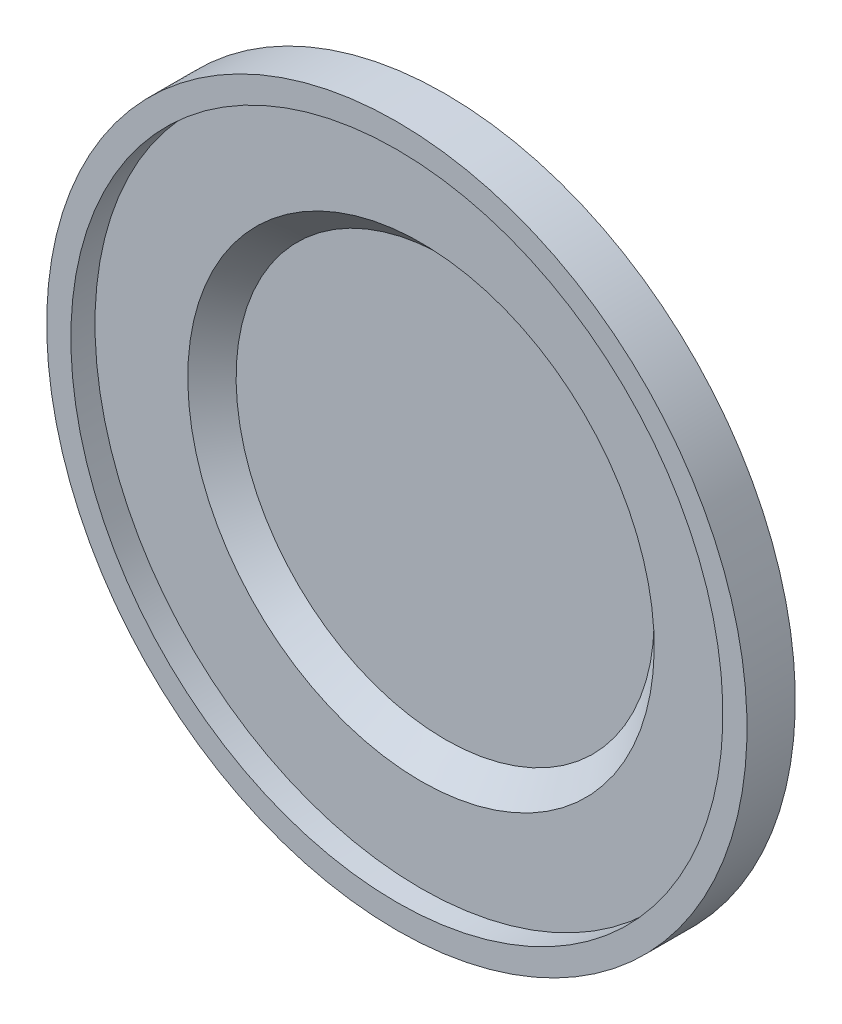
ISO-10303-21;
HEADER;
FILE_DESCRIPTION(('STEP AP214'),'2;1');
FILE_NAME('part.step','',(''),(''),'','','');
FILE_SCHEMA(('AUTOMOTIVE_DESIGN { 1 0 10303 214 1 1 1 1 }'));
ENDSEC;
DATA;
#1=APPLICATION_CONTEXT('core data for automotive mechanical design processes');
#2=APPLICATION_PROTOCOL_DEFINITION('international standard','automotive_design',2000,#1);
#3=PRODUCT_CONTEXT('',#1,'mechanical');
#4=PRODUCT('Part','Part','',(#3));
#5=PRODUCT_RELATED_PRODUCT_CATEGORY('part','',(#4));
#6=PRODUCT_DEFINITION_FORMATION('','',#4);
#7=PRODUCT_DEFINITION_CONTEXT('part definition',#1,'design');
#8=PRODUCT_DEFINITION('design','',#6,#7);
#9=PRODUCT_DEFINITION_SHAPE('','',#8);
#10=(LENGTH_UNIT() NAMED_UNIT(*) SI_UNIT(.MILLI.,.METRE.));
#11=(NAMED_UNIT(*) PLANE_ANGLE_UNIT() SI_UNIT($,.RADIAN.));
#12=(NAMED_UNIT(*) SI_UNIT($,.STERADIAN.) SOLID_ANGLE_UNIT());
#13=UNCERTAINTY_MEASURE_WITH_UNIT(LENGTH_MEASURE(1.E-05),#10,'distance_accuracy_value','');
#14=(GEOMETRIC_REPRESENTATION_CONTEXT(3) GLOBAL_UNCERTAINTY_ASSIGNED_CONTEXT((#13)) GLOBAL_UNIT_ASSIGNED_CONTEXT((#10,
#11,#12)) REPRESENTATION_CONTEXT('',''));
#15=CARTESIAN_POINT('',(0.,0.,0.));
#16=DIRECTION('',(0.,0.,1.));
#17=DIRECTION('',(1.,0.,0.));
#18=AXIS2_PLACEMENT_3D('',#15,#16,#17);
#19=CARTESIAN_POINT('',(0.,8.65676267281725,-2.));
#20=DIRECTION('',(0.,0.,1.));
#21=DIRECTION('',(0.,-1.,0.));
#22=AXIS2_PLACEMENT_3D('',#19,#20,#21);
#23=PLANE('',#22);
#24=CARTESIAN_POINT('',(0.,0.,-1.99999999999871));
#25=DIRECTION('',(0.,0.,1.));
#26=DIRECTION('',(0.,-1.,0.));
#27=AXIS2_PLACEMENT_3D('',#24,#25,#26);
#28=CIRCLE('',#27,8.65676267281598);
#29=CARTESIAN_POINT('',(0.,-8.65676267281598,-1.99999999999871));
#30=VERTEX_POINT('',#29);
#31=EDGE_CURVE('E19',#30,#30,#28,.T.);
#32=ORIENTED_EDGE('',*,*,#31,.T.);
#33=EDGE_LOOP('',(#32));
#34=FACE_BOUND('',#33,.T.);
#35=ADVANCED_FACE('F15',(#34),#23,.T.);
#36=CARTESIAN_POINT('',(0.,0.,-1.00000000000127));
#37=DIRECTION('',(0.,0.,1.));
#38=DIRECTION('',(0.,-1.,0.));
#39=AXIS2_PLACEMENT_3D('',#36,#37,#38);
#40=CONICAL_SURFACE('',#39,9.65676267281853,0.785398163399998);
#41=ORIENTED_EDGE('',*,*,#31,.F.);
#42=EDGE_LOOP('',(#41));
#43=FACE_BOUND('',#42,.T.);
#44=CARTESIAN_POINT('',(0.,0.,-1.00000000000127));
#45=DIRECTION('',(0.,0.,1.));
#46=DIRECTION('',(0.,-1.,0.));
#47=AXIS2_PLACEMENT_3D('',#44,#45,#46);
#48=CIRCLE('',#47,9.65676267281853);
#49=CARTESIAN_POINT('',(0.,-9.65676267281853,-1.00000000000126));
#50=VERTEX_POINT('',#49);
#51=EDGE_CURVE('E41',#50,#50,#48,.F.);
#52=ORIENTED_EDGE('',*,*,#51,.F.);
#53=EDGE_LOOP('',(#52));
#54=FACE_BOUND('',#53,.T.);
#55=ADVANCED_FACE('F49',(#43,#54),#40,.F.);
#56=CARTESIAN_POINT('',(0.,13.5,-0.999999999999996));
#57=DIRECTION('',(0.,0.,1.));
#58=DIRECTION('',(0.,-1.,0.));
#59=AXIS2_PLACEMENT_3D('',#56,#57,#58);
#60=PLANE('',#59);
#61=CARTESIAN_POINT('',(0.,0.,-0.999999999999989));
#62=DIRECTION('',(0.,0.,-1.));
#63=DIRECTION('',(0.,1.,0.));
#64=AXIS2_PLACEMENT_3D('',#61,#62,#63);
#65=CIRCLE('',#64,13.5);
#66=CARTESIAN_POINT('',(0.,13.5,-0.999999999999996));
#67=VERTEX_POINT('',#66);
#68=EDGE_CURVE('E39',#67,#67,#65,.F.);
#69=ORIENTED_EDGE('',*,*,#68,.T.);
#70=EDGE_LOOP('',(#69));
#71=FACE_BOUND('',#70,.T.);
#72=ORIENTED_EDGE('',*,*,#51,.T.);
#73=EDGE_LOOP('',(#72));
#74=FACE_BOUND('',#73,.T.);
#75=ADVANCED_FACE('F52',(#71,#74),#60,.T.);
#76=CARTESIAN_POINT('',(0.,0.,-0.499999999999989));
#77=DIRECTION('',(0.,0.,-1.));
#78=DIRECTION('',(0.,1.,0.));
#79=AXIS2_PLACEMENT_3D('',#76,#77,#78);
#80=CYLINDRICAL_SURFACE('',#79,13.5);
#81=ORIENTED_EDGE('',*,*,#68,.F.);
#82=EDGE_LOOP('',(#81));
#83=FACE_BOUND('',#82,.T.);
#84=CARTESIAN_POINT('',(0.,0.,0.));
#85=DIRECTION('',(0.,0.,-1.));
#86=DIRECTION('',(0.,1.,0.));
#87=AXIS2_PLACEMENT_3D('',#84,#85,#86);
#88=CIRCLE('',#87,13.5);
#89=CARTESIAN_POINT('',(0.,13.5,0.));
#90=VERTEX_POINT('',#89);
#91=EDGE_CURVE('E36',#90,#90,#88,.T.);
#92=ORIENTED_EDGE('',*,*,#91,.F.);
#93=EDGE_LOOP('',(#92));
#94=FACE_BOUND('',#93,.T.);
#95=ADVANCED_FACE('F59',(#83,#94),#80,.F.);
#96=CARTESIAN_POINT('',(0.,14.5,0.));
#97=DIRECTION('',(0.,0.,1.));
#98=DIRECTION('',(0.,-1.,0.));
#99=AXIS2_PLACEMENT_3D('',#96,#97,#98);
#100=PLANE('',#99);
#101=CARTESIAN_POINT('',(0.,0.,0.));
#102=DIRECTION('',(0.,0.,-1.));
#103=DIRECTION('',(0.,1.,0.));
#104=AXIS2_PLACEMENT_3D('',#101,#102,#103);
#105=CIRCLE('',#104,14.5);
#106=CARTESIAN_POINT('',(0.,14.5,0.));
#107=VERTEX_POINT('',#106);
#108=EDGE_CURVE('E33',#107,#107,#105,.T.);
#109=ORIENTED_EDGE('',*,*,#108,.F.);
#110=EDGE_LOOP('',(#109));
#111=FACE_BOUND('',#110,.T.);
#112=ORIENTED_EDGE('',*,*,#91,.T.);
#113=EDGE_LOOP('',(#112));
#114=FACE_BOUND('',#113,.T.);
#115=ADVANCED_FACE('F77',(#111,#114),#100,.T.);
#116=CARTESIAN_POINT('',(0.,0.,-0.999999999999989));
#117=DIRECTION('',(0.,0.,-1.));
#118=DIRECTION('',(0.,1.,0.));
#119=AXIS2_PLACEMENT_3D('',#116,#117,#118);
#120=CYLINDRICAL_SURFACE('',#119,14.5);
#121=ORIENTED_EDGE('',*,*,#108,.T.);
#122=EDGE_LOOP('',(#121));
#123=FACE_BOUND('',#122,.T.);
#124=CARTESIAN_POINT('',(0.,0.,-1.99999999999999));
#125=DIRECTION('',(0.,0.,-1.));
#126=DIRECTION('',(0.,1.,0.));
#127=AXIS2_PLACEMENT_3D('',#124,#125,#126);
#128=CIRCLE('',#127,14.5);
#129=CARTESIAN_POINT('',(0.,14.5,-2.));
#130=VERTEX_POINT('',#129);
#131=EDGE_CURVE('E28',#130,#130,#128,.T.);
#132=ORIENTED_EDGE('',*,*,#131,.F.);
#133=EDGE_LOOP('',(#132));
#134=FACE_BOUND('',#133,.T.);
#135=ADVANCED_FACE('F73',(#123,#134),#120,.T.);
#136=CARTESIAN_POINT('',(0.,12.,-2.));
#137=DIRECTION('',(0.,0.,-1.));
#138=DIRECTION('',(0.,1.,0.));
#139=AXIS2_PLACEMENT_3D('',#136,#137,#138);
#140=PLANE('',#139);
#141=ORIENTED_EDGE('',*,*,#131,.T.);
#142=EDGE_LOOP('',(#141));
#143=FACE_BOUND('',#142,.T.);
#144=CARTESIAN_POINT('',(0.,0.,-1.99999999999999));
#145=DIRECTION('',(0.,0.,-1.));
#146=DIRECTION('',(0.,1.,0.));
#147=AXIS2_PLACEMENT_3D('',#144,#145,#146);
#148=CIRCLE('',#147,12.);
#149=CARTESIAN_POINT('',(0.,12.,-2.));
#150=VERTEX_POINT('',#149);
#151=EDGE_CURVE('E23',#150,#150,#148,.T.);
#152=ORIENTED_EDGE('',*,*,#151,.F.);
#153=EDGE_LOOP('',(#152));
#154=FACE_BOUND('',#153,.T.);
#155=ADVANCED_FACE('F68',(#143,#154),#140,.T.);
#156=CARTESIAN_POINT('',(0.,0.,-2.));
#157=DIRECTION('',(0.,0.,-1.));
#158=DIRECTION('',(0.,1.,0.));
#159=AXIS2_PLACEMENT_3D('',#156,#157,#158);
#160=TOROIDAL_SURFACE('',#159,11.,1.);
#161=ORIENTED_EDGE('',*,*,#151,.T.);
#162=EDGE_LOOP('',(#161));
#163=FACE_BOUND('',#162,.T.);
#164=CARTESIAN_POINT('',(0.,0.,-3.));
#165=DIRECTION('',(0.,0.,-1.));
#166=DIRECTION('',(0.,1.,0.));
#167=AXIS2_PLACEMENT_3D('',#164,#165,#166);
#168=CIRCLE('',#167,11.);
#169=CARTESIAN_POINT('',(0.,11.,-3.00000000000001));
#170=VERTEX_POINT('',#169);
#171=EDGE_CURVE('E10',#170,#170,#168,.T.);
#172=ORIENTED_EDGE('',*,*,#171,.F.);
#173=EDGE_LOOP('',(#172));
#174=FACE_BOUND('',#173,.T.);
#175=ADVANCED_FACE('F17',(#163,#174),#160,.T.);
#176=CARTESIAN_POINT('',(0.,0.,-3.));
#177=DIRECTION('',(0.,0.,-1.));
#178=DIRECTION('',(0.,1.,0.));
#179=AXIS2_PLACEMENT_3D('',#176,#177,#178);
#180=PLANE('',#179);
#181=ORIENTED_EDGE('',*,*,#171,.T.);
#182=EDGE_LOOP('',(#181));
#183=FACE_BOUND('',#182,.T.);
#184=ADVANCED_FACE('F62',(#183),#180,.T.);
#185=CLOSED_SHELL('',(#35,#55,#75,#95,#115,#135,#155,#175,#184));
#186=MANIFOLD_SOLID_BREP('B1',#185);
#187=ADVANCED_BREP_SHAPE_REPRESENTATION('',(#18,#186),#14);
#188=SHAPE_DEFINITION_REPRESENTATION(#9,#187);
ENDSEC;
END-ISO-10303-21;
